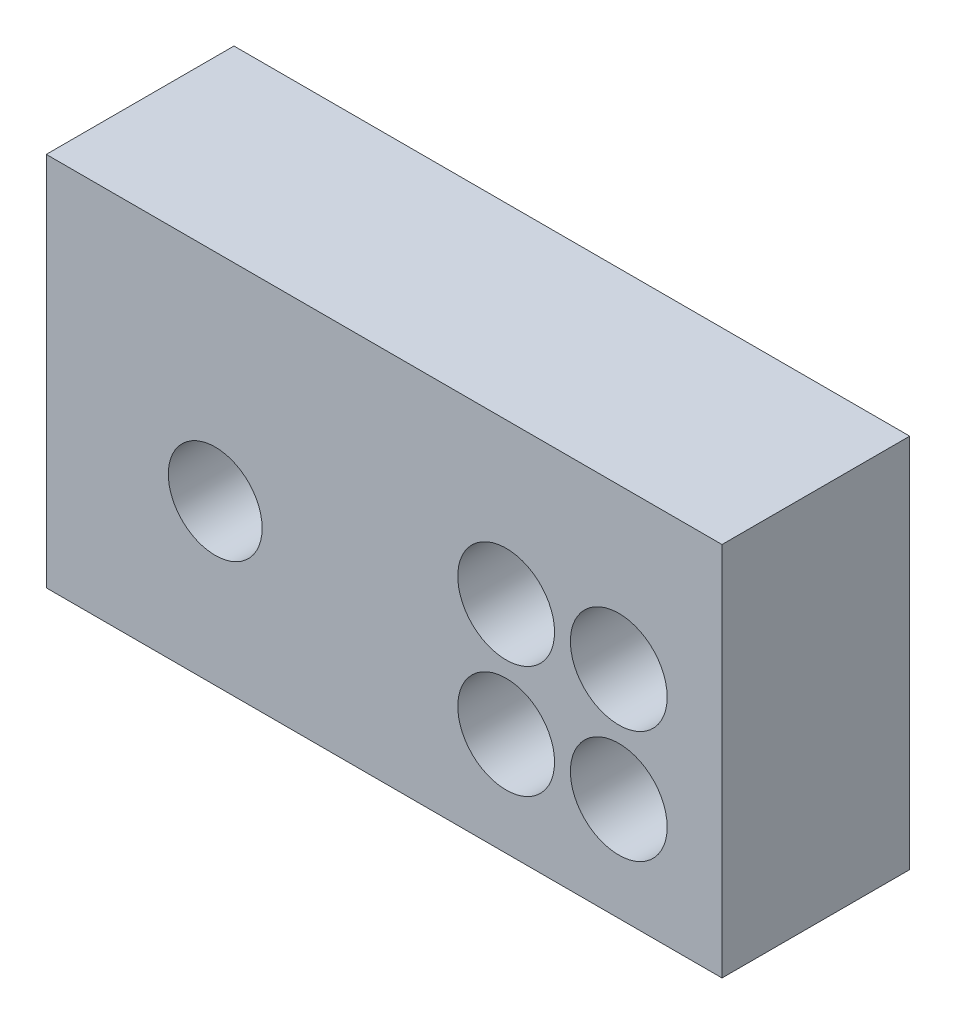
ISO-10303-21;
HEADER;
FILE_DESCRIPTION(('STEP AP214'),'2;1');
FILE_NAME('part.step','',(''),(''),'','','');
FILE_SCHEMA(('AUTOMOTIVE_DESIGN { 1 0 10303 214 1 1 1 1 }'));
ENDSEC;
DATA;
#1=APPLICATION_CONTEXT('core data for automotive mechanical design processes');
#2=APPLICATION_PROTOCOL_DEFINITION('international standard','automotive_design',2000,#1);
#3=PRODUCT_CONTEXT('',#1,'mechanical');
#4=PRODUCT('Part','Part','',(#3));
#5=PRODUCT_RELATED_PRODUCT_CATEGORY('part','',(#4));
#6=PRODUCT_DEFINITION_FORMATION('','',#4);
#7=PRODUCT_DEFINITION_CONTEXT('part definition',#1,'design');
#8=PRODUCT_DEFINITION('design','',#6,#7);
#9=PRODUCT_DEFINITION_SHAPE('','',#8);
#10=(LENGTH_UNIT() NAMED_UNIT(*) SI_UNIT(.MILLI.,.METRE.));
#11=(NAMED_UNIT(*) PLANE_ANGLE_UNIT() SI_UNIT($,.RADIAN.));
#12=(NAMED_UNIT(*) SI_UNIT($,.STERADIAN.) SOLID_ANGLE_UNIT());
#13=UNCERTAINTY_MEASURE_WITH_UNIT(LENGTH_MEASURE(1.E-05),#10,'distance_accuracy_value','');
#14=(GEOMETRIC_REPRESENTATION_CONTEXT(3) GLOBAL_UNCERTAINTY_ASSIGNED_CONTEXT((#13)) GLOBAL_UNIT_ASSIGNED_CONTEXT((#10,
#11,#12)) REPRESENTATION_CONTEXT('',''));
#15=CARTESIAN_POINT('',(0.,0.,0.));
#16=DIRECTION('',(0.,0.,1.));
#17=DIRECTION('',(1.,0.,0.));
#18=AXIS2_PLACEMENT_3D('',#15,#16,#17);
#19=CARTESIAN_POINT('',(-49.2709424083769,25.0564572425829,1.));
#20=DIRECTION('',(1.,0.,0.));
#21=DIRECTION('',(0.,0.,-1.));
#22=AXIS2_PLACEMENT_3D('',#19,#20,#21);
#23=PLANE('',#22);
#24=DIRECTION('',(0.,-1.,0.));
#25=VECTOR('',#24,1.);
#26=CARTESIAN_POINT('',(-49.2709424083769,25.0564572425829,0.));
#27=LINE('',#26,#25);
#28=CARTESIAN_POINT('',(-49.2709424083769,25.0564572425829,0.));
#29=VERTEX_POINT('',#28);
#30=CARTESIAN_POINT('',(-49.2709424083769,23.0564572425829,0.));
#31=VERTEX_POINT('',#30);
#32=EDGE_CURVE('E97',#29,#31,#27,.T.);
#33=ORIENTED_EDGE('',*,*,#32,.T.);
#34=DIRECTION('',(0.,0.,-1.));
#35=VECTOR('',#34,1.);
#36=CARTESIAN_POINT('',(-49.2709424083769,23.0564572425829,1.));
#37=LINE('',#36,#35);
#38=CARTESIAN_POINT('',(-49.2709424083769,23.0564572425829,1.));
#39=VERTEX_POINT('',#38);
#40=EDGE_CURVE('E11',#39,#31,#37,.T.);
#41=ORIENTED_EDGE('',*,*,#40,.F.);
#42=DIRECTION('',(0.,-1.,0.));
#43=VECTOR('',#42,1.);
#44=CARTESIAN_POINT('',(-49.2709424083769,25.0564572425829,1.));
#45=LINE('',#44,#43);
#46=CARTESIAN_POINT('',(-49.2709424083769,25.0564572425829,1.));
#47=VERTEX_POINT('',#46);
#48=EDGE_CURVE('E85',#47,#39,#45,.T.);
#49=ORIENTED_EDGE('',*,*,#48,.F.);
#50=DIRECTION('',(0.,0.,-1.));
#51=VECTOR('',#50,1.);
#52=CARTESIAN_POINT('',(-49.2709424083769,25.0564572425829,1.));
#53=LINE('',#52,#51);
#54=EDGE_CURVE('E93',#47,#29,#53,.T.);
#55=ORIENTED_EDGE('',*,*,#54,.T.);
#56=EDGE_LOOP('',(#33,#41,#49,#55));
#57=FACE_BOUND('',#56,.T.);
#58=ADVANCED_FACE('F34',(#57),#23,.F.);
#59=CARTESIAN_POINT('',(-49.2709424083769,23.0564572425829,1.));
#60=DIRECTION('',(0.,1.,0.));
#61=DIRECTION('',(0.,0.,1.));
#62=AXIS2_PLACEMENT_3D('',#59,#60,#61);
#63=PLANE('',#62);
#64=DIRECTION('',(1.,0.,0.));
#65=VECTOR('',#64,1.);
#66=CARTESIAN_POINT('',(-49.2709424083769,23.0564572425829,0.));
#67=LINE('',#66,#65);
#68=CARTESIAN_POINT('',(-45.670942408377,23.0564572425829,0.));
#69=VERTEX_POINT('',#68);
#70=EDGE_CURVE('E89',#31,#69,#67,.T.);
#71=ORIENTED_EDGE('',*,*,#70,.T.);
#72=DIRECTION('',(0.,0.,-1.));
#73=VECTOR('',#72,1.);
#74=CARTESIAN_POINT('',(-45.670942408377,23.0564572425829,1.));
#75=LINE('',#74,#73);
#76=CARTESIAN_POINT('',(-45.670942408377,23.0564572425829,1.));
#77=VERTEX_POINT('',#76);
#78=EDGE_CURVE('E42',#77,#69,#75,.T.);
#79=ORIENTED_EDGE('',*,*,#78,.F.);
#80=DIRECTION('',(1.,0.,0.));
#81=VECTOR('',#80,1.);
#82=CARTESIAN_POINT('',(-49.2709424083769,23.0564572425829,1.));
#83=LINE('',#82,#81);
#84=EDGE_CURVE('E80',#39,#77,#83,.T.);
#85=ORIENTED_EDGE('',*,*,#84,.F.);
#86=ORIENTED_EDGE('',*,*,#40,.T.);
#87=EDGE_LOOP('',(#71,#79,#85,#86));
#88=FACE_BOUND('',#87,.T.);
#89=ADVANCED_FACE('F88',(#88),#63,.F.);
#90=CARTESIAN_POINT('',(-45.670942408377,25.0564572425829,1.));
#91=DIRECTION('',(-1.,0.,0.));
#92=DIRECTION('',(0.,0.,1.));
#93=AXIS2_PLACEMENT_3D('',#90,#91,#92);
#94=PLANE('',#93);
#95=DIRECTION('',(0.,1.,0.));
#96=VECTOR('',#95,1.);
#97=CARTESIAN_POINT('',(-45.670942408377,25.0564572425829,0.));
#98=LINE('',#97,#96);
#99=CARTESIAN_POINT('',(-45.670942408377,25.0564572425829,0.));
#100=VERTEX_POINT('',#99);
#101=EDGE_CURVE('E67',#69,#100,#98,.T.);
#102=ORIENTED_EDGE('',*,*,#101,.T.);
#103=DIRECTION('',(0.,0.,-1.));
#104=VECTOR('',#103,1.);
#105=CARTESIAN_POINT('',(-45.670942408377,25.0564572425829,1.));
#106=LINE('',#105,#104);
#107=CARTESIAN_POINT('',(-45.670942408377,25.0564572425829,1.));
#108=VERTEX_POINT('',#107);
#109=EDGE_CURVE('E90',#108,#100,#106,.T.);
#110=ORIENTED_EDGE('',*,*,#109,.F.);
#111=DIRECTION('',(0.,1.,0.));
#112=VECTOR('',#111,1.);
#113=CARTESIAN_POINT('',(-45.670942408377,25.0564572425829,1.));
#114=LINE('',#113,#112);
#115=EDGE_CURVE('E83',#77,#108,#114,.T.);
#116=ORIENTED_EDGE('',*,*,#115,.F.);
#117=ORIENTED_EDGE('',*,*,#78,.T.);
#118=EDGE_LOOP('',(#102,#110,#116,#117));
#119=FACE_BOUND('',#118,.T.);
#120=ADVANCED_FACE('F91',(#119),#94,.F.);
#121=CARTESIAN_POINT('',(-49.2709424083769,25.0564572425829,1.));
#122=DIRECTION('',(0.,-1.,0.));
#123=DIRECTION('',(0.,0.,-1.));
#124=AXIS2_PLACEMENT_3D('',#121,#122,#123);
#125=PLANE('',#124);
#126=DIRECTION('',(-1.,0.,0.));
#127=VECTOR('',#126,1.);
#128=CARTESIAN_POINT('',(-49.2709424083769,25.0564572425829,0.));
#129=LINE('',#128,#127);
#130=EDGE_CURVE('E73',#100,#29,#129,.T.);
#131=ORIENTED_EDGE('',*,*,#130,.T.);
#132=ORIENTED_EDGE('',*,*,#54,.F.);
#133=DIRECTION('',(-1.,0.,0.));
#134=VECTOR('',#133,1.);
#135=CARTESIAN_POINT('',(-49.2709424083769,25.0564572425829,1.));
#136=LINE('',#135,#134);
#137=EDGE_CURVE('E50',#108,#47,#136,.T.);
#138=ORIENTED_EDGE('',*,*,#137,.F.);
#139=ORIENTED_EDGE('',*,*,#109,.T.);
#140=EDGE_LOOP('',(#131,#132,#138,#139));
#141=FACE_BOUND('',#140,.T.);
#142=ADVANCED_FACE('F105',(#141),#125,.F.);
#143=CARTESIAN_POINT('',(-49.2709424083769,23.0564572425829,1.));
#144=DIRECTION('',(0.,0.,1.));
#145=DIRECTION('',(1.,0.,0.));
#146=AXIS2_PLACEMENT_3D('',#143,#144,#145);
#147=PLANE('',#146);
#148=CARTESIAN_POINT('',(-46.220942408377,24.2064572425829,1.));
#149=DIRECTION('',(0.,0.,1.));
#150=DIRECTION('',(1.,0.,0.));
#151=AXIS2_PLACEMENT_3D('',#148,#149,#150);
#152=CIRCLE('',#151,0.257810000000018);
#153=CARTESIAN_POINT('',(-45.963132408377,24.2064572425829,1.));
#154=VERTEX_POINT('',#153);
#155=EDGE_CURVE('E135',#154,#154,#152,.T.);
#156=ORIENTED_EDGE('',*,*,#155,.F.);
#157=EDGE_LOOP('',(#156));
#158=FACE_BOUND('',#157,.T.);
#159=CARTESIAN_POINT('',(-46.2209424083769,23.6064572425829,1.));
#160=DIRECTION('',(0.,0.,1.));
#161=DIRECTION('',(1.,0.,0.));
#162=AXIS2_PLACEMENT_3D('',#159,#160,#161);
#163=CIRCLE('',#162,0.257809999999996);
#164=CARTESIAN_POINT('',(-45.963132408377,23.6064572425829,1.));
#165=VERTEX_POINT('',#164);
#166=EDGE_CURVE('E129',#165,#165,#163,.T.);
#167=ORIENTED_EDGE('',*,*,#166,.F.);
#168=EDGE_LOOP('',(#167));
#169=FACE_BOUND('',#168,.T.);
#170=CARTESIAN_POINT('',(-46.820942408377,23.6064572425829,1.));
#171=DIRECTION('',(0.,0.,1.));
#172=DIRECTION('',(1.,0.,0.));
#173=AXIS2_PLACEMENT_3D('',#170,#171,#172);
#174=CIRCLE('',#173,0.257809999999996);
#175=CARTESIAN_POINT('',(-46.563132408377,23.6064572425829,1.));
#176=VERTEX_POINT('',#175);
#177=EDGE_CURVE('E123',#176,#176,#174,.T.);
#178=ORIENTED_EDGE('',*,*,#177,.F.);
#179=EDGE_LOOP('',(#178));
#180=FACE_BOUND('',#179,.T.);
#181=CARTESIAN_POINT('',(-46.820942408377,24.2064572425829,1.));
#182=DIRECTION('',(0.,0.,1.));
#183=DIRECTION('',(1.,0.,0.));
#184=AXIS2_PLACEMENT_3D('',#181,#182,#183);
#185=CIRCLE('',#184,0.25781000000001);
#186=CARTESIAN_POINT('',(-46.563132408377,24.2064572425829,1.));
#187=VERTEX_POINT('',#186);
#188=EDGE_CURVE('E117',#187,#187,#185,.T.);
#189=ORIENTED_EDGE('',*,*,#188,.F.);
#190=EDGE_LOOP('',(#189));
#191=FACE_BOUND('',#190,.T.);
#192=CARTESIAN_POINT('',(-48.3709424083769,23.9064572425829,1.));
#193=DIRECTION('',(0.,0.,1.));
#194=DIRECTION('',(1.,0.,0.));
#195=AXIS2_PLACEMENT_3D('',#192,#193,#194);
#196=CIRCLE('',#195,0.25);
#197=CARTESIAN_POINT('',(-48.1209424083769,23.9064572425829,1.));
#198=VERTEX_POINT('',#197);
#199=EDGE_CURVE('E111',#198,#198,#196,.T.);
#200=ORIENTED_EDGE('',*,*,#199,.F.);
#201=EDGE_LOOP('',(#200));
#202=FACE_BOUND('',#201,.T.);
#203=ORIENTED_EDGE('',*,*,#48,.T.);
#204=ORIENTED_EDGE('',*,*,#84,.T.);
#205=ORIENTED_EDGE('',*,*,#115,.T.);
#206=ORIENTED_EDGE('',*,*,#137,.T.);
#207=EDGE_LOOP('',(#203,#204,#205,#206));
#208=FACE_BOUND('',#207,.T.);
#209=ADVANCED_FACE('F81',(#158,#169,#180,#191,#202,#208),#147,.T.);
#210=CARTESIAN_POINT('',(-49.2709424083769,23.0564572425829,0.));
#211=DIRECTION('',(0.,0.,1.));
#212=DIRECTION('',(1.,0.,0.));
#213=AXIS2_PLACEMENT_3D('',#210,#211,#212);
#214=PLANE('',#213);
#215=CARTESIAN_POINT('',(-46.220942408377,24.2064572425829,0.));
#216=DIRECTION('',(0.,0.,1.));
#217=DIRECTION('',(1.,0.,0.));
#218=AXIS2_PLACEMENT_3D('',#215,#216,#217);
#219=CIRCLE('',#218,0.257810000000018);
#220=CARTESIAN_POINT('',(-45.963132408377,24.2064572425829,0.));
#221=VERTEX_POINT('',#220);
#222=EDGE_CURVE('E132',#221,#221,#219,.T.);
#223=ORIENTED_EDGE('',*,*,#222,.T.);
#224=EDGE_LOOP('',(#223));
#225=FACE_BOUND('',#224,.T.);
#226=CARTESIAN_POINT('',(-46.2209424083769,23.6064572425829,0.));
#227=DIRECTION('',(0.,0.,1.));
#228=DIRECTION('',(1.,0.,0.));
#229=AXIS2_PLACEMENT_3D('',#226,#227,#228);
#230=CIRCLE('',#229,0.257809999999996);
#231=CARTESIAN_POINT('',(-45.963132408377,23.6064572425829,0.));
#232=VERTEX_POINT('',#231);
#233=EDGE_CURVE('E126',#232,#232,#230,.T.);
#234=ORIENTED_EDGE('',*,*,#233,.T.);
#235=EDGE_LOOP('',(#234));
#236=FACE_BOUND('',#235,.T.);
#237=CARTESIAN_POINT('',(-46.820942408377,23.6064572425829,0.));
#238=DIRECTION('',(0.,0.,1.));
#239=DIRECTION('',(1.,0.,0.));
#240=AXIS2_PLACEMENT_3D('',#237,#238,#239);
#241=CIRCLE('',#240,0.257809999999996);
#242=CARTESIAN_POINT('',(-46.563132408377,23.6064572425829,0.));
#243=VERTEX_POINT('',#242);
#244=EDGE_CURVE('E120',#243,#243,#241,.T.);
#245=ORIENTED_EDGE('',*,*,#244,.T.);
#246=EDGE_LOOP('',(#245));
#247=FACE_BOUND('',#246,.T.);
#248=CARTESIAN_POINT('',(-46.820942408377,24.2064572425829,0.));
#249=DIRECTION('',(0.,0.,1.));
#250=DIRECTION('',(1.,0.,0.));
#251=AXIS2_PLACEMENT_3D('',#248,#249,#250);
#252=CIRCLE('',#251,0.25781000000001);
#253=CARTESIAN_POINT('',(-46.563132408377,24.2064572425829,0.));
#254=VERTEX_POINT('',#253);
#255=EDGE_CURVE('E114',#254,#254,#252,.T.);
#256=ORIENTED_EDGE('',*,*,#255,.T.);
#257=EDGE_LOOP('',(#256));
#258=FACE_BOUND('',#257,.T.);
#259=CARTESIAN_POINT('',(-48.3709424083769,23.9064572425829,0.));
#260=DIRECTION('',(0.,0.,1.));
#261=DIRECTION('',(1.,0.,0.));
#262=AXIS2_PLACEMENT_3D('',#259,#260,#261);
#263=CIRCLE('',#262,0.25);
#264=CARTESIAN_POINT('',(-48.1209424083769,23.9064572425829,0.));
#265=VERTEX_POINT('',#264);
#266=EDGE_CURVE('E100',#265,#265,#263,.T.);
#267=ORIENTED_EDGE('',*,*,#266,.T.);
#268=EDGE_LOOP('',(#267));
#269=FACE_BOUND('',#268,.T.);
#270=ORIENTED_EDGE('',*,*,#32,.F.);
#271=ORIENTED_EDGE('',*,*,#130,.F.);
#272=ORIENTED_EDGE('',*,*,#101,.F.);
#273=ORIENTED_EDGE('',*,*,#70,.F.);
#274=EDGE_LOOP('',(#270,#271,#272,#273));
#275=FACE_BOUND('',#274,.T.);
#276=ADVANCED_FACE('F108',(#225,#236,#247,#258,#269,#275),#214,.F.);
#277=CARTESIAN_POINT('',(-48.3709424083769,23.9064572425829,0.));
#278=DIRECTION('',(0.,0.,1.));
#279=DIRECTION('',(1.,0.,0.));
#280=AXIS2_PLACEMENT_3D('',#277,#278,#279);
#281=CYLINDRICAL_SURFACE('',#280,0.25);
#282=ORIENTED_EDGE('',*,*,#266,.F.);
#283=EDGE_LOOP('',(#282));
#284=FACE_BOUND('',#283,.T.);
#285=ORIENTED_EDGE('',*,*,#199,.T.);
#286=EDGE_LOOP('',(#285));
#287=FACE_BOUND('',#286,.T.);
#288=ADVANCED_FACE('F161',(#284,#287),#281,.F.);
#289=CARTESIAN_POINT('',(-46.820942408377,24.2064572425829,0.));
#290=DIRECTION('',(0.,0.,1.));
#291=DIRECTION('',(1.,0.,0.));
#292=AXIS2_PLACEMENT_3D('',#289,#290,#291);
#293=CYLINDRICAL_SURFACE('',#292,0.25781000000001);
#294=ORIENTED_EDGE('',*,*,#255,.F.);
#295=EDGE_LOOP('',(#294));
#296=FACE_BOUND('',#295,.T.);
#297=ORIENTED_EDGE('',*,*,#188,.T.);
#298=EDGE_LOOP('',(#297));
#299=FACE_BOUND('',#298,.T.);
#300=ADVANCED_FACE('F163',(#296,#299),#293,.F.);
#301=CARTESIAN_POINT('',(-46.820942408377,23.6064572425829,0.));
#302=DIRECTION('',(0.,0.,1.));
#303=DIRECTION('',(1.,0.,0.));
#304=AXIS2_PLACEMENT_3D('',#301,#302,#303);
#305=CYLINDRICAL_SURFACE('',#304,0.257809999999996);
#306=ORIENTED_EDGE('',*,*,#244,.F.);
#307=EDGE_LOOP('',(#306));
#308=FACE_BOUND('',#307,.T.);
#309=ORIENTED_EDGE('',*,*,#177,.T.);
#310=EDGE_LOOP('',(#309));
#311=FACE_BOUND('',#310,.T.);
#312=ADVANCED_FACE('F170',(#308,#311),#305,.F.);
#313=CARTESIAN_POINT('',(-46.2209424083769,23.6064572425829,0.));
#314=DIRECTION('',(0.,0.,1.));
#315=DIRECTION('',(1.,0.,0.));
#316=AXIS2_PLACEMENT_3D('',#313,#314,#315);
#317=CYLINDRICAL_SURFACE('',#316,0.257809999999996);
#318=ORIENTED_EDGE('',*,*,#233,.F.);
#319=EDGE_LOOP('',(#318));
#320=FACE_BOUND('',#319,.T.);
#321=ORIENTED_EDGE('',*,*,#166,.T.);
#322=EDGE_LOOP('',(#321));
#323=FACE_BOUND('',#322,.T.);
#324=ADVANCED_FACE('F146',(#320,#323),#317,.F.);
#325=CARTESIAN_POINT('',(-46.220942408377,24.2064572425829,0.));
#326=DIRECTION('',(0.,0.,1.));
#327=DIRECTION('',(1.,0.,0.));
#328=AXIS2_PLACEMENT_3D('',#325,#326,#327);
#329=CYLINDRICAL_SURFACE('',#328,0.257810000000018);
#330=ORIENTED_EDGE('',*,*,#222,.F.);
#331=EDGE_LOOP('',(#330));
#332=FACE_BOUND('',#331,.T.);
#333=ORIENTED_EDGE('',*,*,#155,.T.);
#334=EDGE_LOOP('',(#333));
#335=FACE_BOUND('',#334,.T.);
#336=ADVANCED_FACE('F143',(#332,#335),#329,.F.);
#337=CLOSED_SHELL('',(#58,#89,#120,#142,#209,#276,#288,#300,#312,#324,#336));
#338=MANIFOLD_SOLID_BREP('B2',#337);
#339=ADVANCED_BREP_SHAPE_REPRESENTATION('',(#18,#338),#14);
#340=SHAPE_DEFINITION_REPRESENTATION(#9,#339);
ENDSEC;
END-ISO-10303-21;
